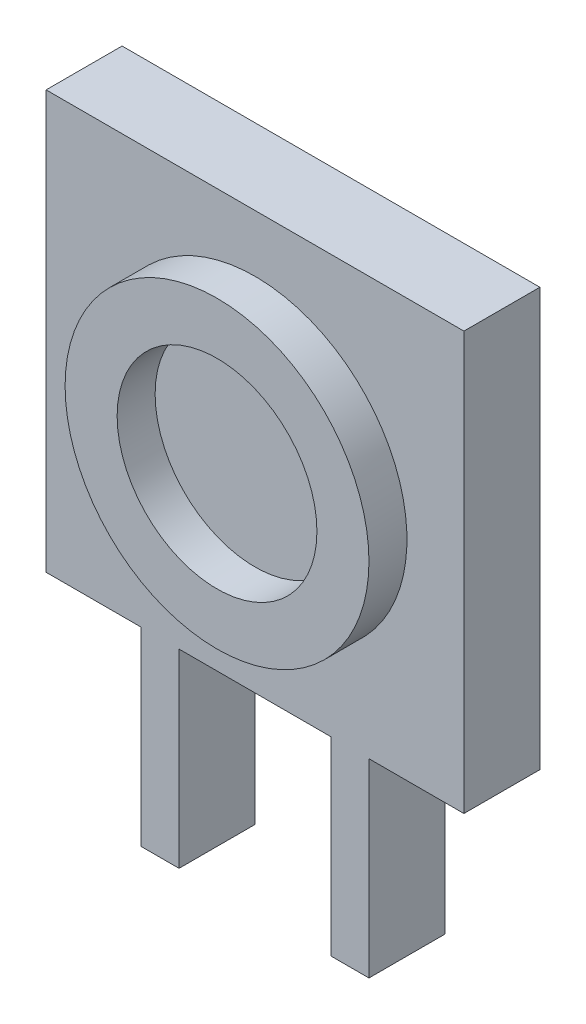
ISO-10303-21;
HEADER;
FILE_DESCRIPTION(('STEP AP214'),'2;1');
FILE_NAME('part.step','',(''),(''),'','','');
FILE_SCHEMA(('AUTOMOTIVE_DESIGN { 1 0 10303 214 1 1 1 1 }'));
ENDSEC;
DATA;
#1=APPLICATION_CONTEXT('core data for automotive mechanical design processes');
#2=APPLICATION_PROTOCOL_DEFINITION('international standard','automotive_design',2000,#1);
#3=PRODUCT_CONTEXT('',#1,'mechanical');
#4=PRODUCT('Part','Part','',(#3));
#5=PRODUCT_RELATED_PRODUCT_CATEGORY('part','',(#4));
#6=PRODUCT_DEFINITION_FORMATION('','',#4);
#7=PRODUCT_DEFINITION_CONTEXT('part definition',#1,'design');
#8=PRODUCT_DEFINITION('design','',#6,#7);
#9=PRODUCT_DEFINITION_SHAPE('','',#8);
#10=(LENGTH_UNIT() NAMED_UNIT(*) SI_UNIT(.MILLI.,.METRE.));
#11=(NAMED_UNIT(*) PLANE_ANGLE_UNIT() SI_UNIT($,.RADIAN.));
#12=(NAMED_UNIT(*) SI_UNIT($,.STERADIAN.) SOLID_ANGLE_UNIT());
#13=UNCERTAINTY_MEASURE_WITH_UNIT(LENGTH_MEASURE(1.E-05),#10,'distance_accuracy_value','');
#14=(GEOMETRIC_REPRESENTATION_CONTEXT(3) GLOBAL_UNCERTAINTY_ASSIGNED_CONTEXT((#13)) GLOBAL_UNIT_ASSIGNED_CONTEXT((#10,
#11,#12)) REPRESENTATION_CONTEXT('',''));
#15=CARTESIAN_POINT('',(0.,0.,0.));
#16=DIRECTION('',(0.,0.,1.));
#17=DIRECTION('',(1.,0.,0.));
#18=AXIS2_PLACEMENT_3D('',#15,#16,#17);
#19=CARTESIAN_POINT('',(-5.5,-10.5,2.));
#20=DIRECTION('',(0.,0.,-1.));
#21=DIRECTION('',(-1.,0.,0.));
#22=AXIS2_PLACEMENT_3D('',#19,#20,#21);
#23=PLANE('',#22);
#24=DIRECTION('',(0.,-1.,0.));
#25=VECTOR('',#24,1.);
#26=CARTESIAN_POINT('',(-5.5,-5.5,2.));
#27=LINE('',#26,#25);
#28=CARTESIAN_POINT('',(-5.5,5.5,2.));
#29=VERTEX_POINT('',#28);
#30=CARTESIAN_POINT('',(-5.5,-5.5,2.));
#31=VERTEX_POINT('',#30);
#32=EDGE_CURVE('E176',#29,#31,#27,.T.);
#33=ORIENTED_EDGE('',*,*,#32,.T.);
#34=DIRECTION('',(1.,0.,0.));
#35=VECTOR('',#34,1.);
#36=CARTESIAN_POINT('',(-5.5,-5.5,2.));
#37=LINE('',#36,#35);
#38=CARTESIAN_POINT('',(-3.,-5.5,2.));
#39=VERTEX_POINT('',#38);
#40=EDGE_CURVE('E104',#31,#39,#37,.T.);
#41=ORIENTED_EDGE('',*,*,#40,.T.);
#42=DIRECTION('',(0.,-1.,0.));
#43=VECTOR('',#42,1.);
#44=CARTESIAN_POINT('',(-3.,-5.5,2.));
#45=LINE('',#44,#43);
#46=CARTESIAN_POINT('',(-3.,-10.5,2.));
#47=VERTEX_POINT('',#46);
#48=EDGE_CURVE('E221',#39,#47,#45,.T.);
#49=ORIENTED_EDGE('',*,*,#48,.T.);
#50=DIRECTION('',(1.,0.,0.));
#51=VECTOR('',#50,1.);
#52=CARTESIAN_POINT('',(-3.,-10.5,2.));
#53=LINE('',#52,#51);
#54=CARTESIAN_POINT('',(-2.,-10.5,2.));
#55=VERTEX_POINT('',#54);
#56=EDGE_CURVE('E218',#47,#55,#53,.T.);
#57=ORIENTED_EDGE('',*,*,#56,.T.);
#58=DIRECTION('',(0.,1.,0.));
#59=VECTOR('',#58,1.);
#60=CARTESIAN_POINT('',(-2.,-5.5,2.));
#61=LINE('',#60,#59);
#62=CARTESIAN_POINT('',(-2.,-5.5,2.));
#63=VERTEX_POINT('',#62);
#64=EDGE_CURVE('E220',#55,#63,#61,.T.);
#65=ORIENTED_EDGE('',*,*,#64,.T.);
#66=DIRECTION('',(1.,0.,0.));
#67=VECTOR('',#66,1.);
#68=CARTESIAN_POINT('',(-2.,-5.5,2.));
#69=LINE('',#68,#67);
#70=CARTESIAN_POINT('',(2.,-5.5,2.));
#71=VERTEX_POINT('',#70);
#72=EDGE_CURVE('E223',#63,#71,#69,.T.);
#73=ORIENTED_EDGE('',*,*,#72,.T.);
#74=DIRECTION('',(0.,-1.,0.));
#75=VECTOR('',#74,1.);
#76=CARTESIAN_POINT('',(2.,-5.5,2.));
#77=LINE('',#76,#75);
#78=CARTESIAN_POINT('',(2.,-10.5,2.));
#79=VERTEX_POINT('',#78);
#80=EDGE_CURVE('E229',#71,#79,#77,.T.);
#81=ORIENTED_EDGE('',*,*,#80,.T.);
#82=DIRECTION('',(1.,0.,0.));
#83=VECTOR('',#82,1.);
#84=CARTESIAN_POINT('',(2.,-10.5,2.));
#85=LINE('',#84,#83);
#86=CARTESIAN_POINT('',(3.,-10.5,2.));
#87=VERTEX_POINT('',#86);
#88=EDGE_CURVE('E231',#79,#87,#85,.T.);
#89=ORIENTED_EDGE('',*,*,#88,.T.);
#90=DIRECTION('',(0.,1.,0.));
#91=VECTOR('',#90,1.);
#92=CARTESIAN_POINT('',(3.,-5.5,2.));
#93=LINE('',#92,#91);
#94=CARTESIAN_POINT('',(3.,-5.5,2.));
#95=VERTEX_POINT('',#94);
#96=EDGE_CURVE('E135',#87,#95,#93,.T.);
#97=ORIENTED_EDGE('',*,*,#96,.T.);
#98=DIRECTION('',(1.,0.,0.));
#99=VECTOR('',#98,1.);
#100=CARTESIAN_POINT('',(3.,-5.5,2.));
#101=LINE('',#100,#99);
#102=CARTESIAN_POINT('',(5.5,-5.5,2.));
#103=VERTEX_POINT('',#102);
#104=EDGE_CURVE('E129',#95,#103,#101,.T.);
#105=ORIENTED_EDGE('',*,*,#104,.T.);
#106=DIRECTION('',(0.,1.,0.));
#107=VECTOR('',#106,1.);
#108=CARTESIAN_POINT('',(5.5,-5.5,2.));
#109=LINE('',#108,#107);
#110=CARTESIAN_POINT('',(5.5,5.5,2.));
#111=VERTEX_POINT('',#110);
#112=EDGE_CURVE('E133',#103,#111,#109,.T.);
#113=ORIENTED_EDGE('',*,*,#112,.T.);
#114=DIRECTION('',(-1.,0.,0.));
#115=VECTOR('',#114,1.);
#116=CARTESIAN_POINT('',(-5.5,5.5,2.));
#117=LINE('',#116,#115);
#118=EDGE_CURVE('E48',#111,#29,#117,.T.);
#119=ORIENTED_EDGE('',*,*,#118,.T.);
#120=EDGE_LOOP('',(#33,#41,#49,#57,#65,#73,#81,#89,#97,#105,#113,#119));
#121=FACE_BOUND('',#120,.T.);
#122=CARTESIAN_POINT('',(0.,0.,2.));
#123=DIRECTION('',(0.,0.,-1.));
#124=DIRECTION('',(-1.,0.,0.));
#125=AXIS2_PLACEMENT_3D('',#122,#123,#124);
#126=CIRCLE('',#125,4.);
#127=CARTESIAN_POINT('',(-4.,0.,2.));
#128=VERTEX_POINT('',#127);
#129=EDGE_CURVE('E11',#128,#128,#126,.F.);
#130=ORIENTED_EDGE('',*,*,#129,.F.);
#131=EDGE_LOOP('',(#130));
#132=FACE_BOUND('',#131,.T.);
#133=ADVANCED_FACE('F31',(#121,#132),#23,.F.);
#134=CARTESIAN_POINT('',(-5.5,-5.5,2.));
#135=DIRECTION('',(1.,0.,0.));
#136=DIRECTION('',(0.,0.,-1.));
#137=AXIS2_PLACEMENT_3D('',#134,#135,#136);
#138=PLANE('',#137);
#139=DIRECTION('',(0.,-1.,0.));
#140=VECTOR('',#139,1.);
#141=CARTESIAN_POINT('',(-5.5,-5.5,0.));
#142=LINE('',#141,#140);
#143=CARTESIAN_POINT('',(-5.5,5.5,0.));
#144=VERTEX_POINT('',#143);
#145=CARTESIAN_POINT('',(-5.5,-5.5,0.));
#146=VERTEX_POINT('',#145);
#147=EDGE_CURVE('E153',#144,#146,#142,.T.);
#148=ORIENTED_EDGE('',*,*,#147,.T.);
#149=DIRECTION('',(0.,0.,-1.));
#150=VECTOR('',#149,1.);
#151=CARTESIAN_POINT('',(-5.5,-5.5,2.));
#152=LINE('',#151,#150);
#153=EDGE_CURVE('E40',#31,#146,#152,.T.);
#154=ORIENTED_EDGE('',*,*,#153,.F.);
#155=ORIENTED_EDGE('',*,*,#32,.F.);
#156=DIRECTION('',(0.,0.,-1.));
#157=VECTOR('',#156,1.);
#158=CARTESIAN_POINT('',(-5.5,5.5,2.));
#159=LINE('',#158,#157);
#160=EDGE_CURVE('E149',#29,#144,#159,.T.);
#161=ORIENTED_EDGE('',*,*,#160,.T.);
#162=EDGE_LOOP('',(#148,#154,#155,#161));
#163=FACE_BOUND('',#162,.T.);
#164=ADVANCED_FACE('F33',(#163),#138,.F.);
#165=CARTESIAN_POINT('',(-5.5,-5.5,2.));
#166=DIRECTION('',(0.,1.,0.));
#167=DIRECTION('',(0.,0.,1.));
#168=AXIS2_PLACEMENT_3D('',#165,#166,#167);
#169=PLANE('',#168);
#170=DIRECTION('',(1.,0.,0.));
#171=VECTOR('',#170,1.);
#172=CARTESIAN_POINT('',(-5.5,-5.5,0.));
#173=LINE('',#172,#171);
#174=CARTESIAN_POINT('',(-3.,-5.5,0.));
#175=VERTEX_POINT('',#174);
#176=EDGE_CURVE('E156',#146,#175,#173,.T.);
#177=ORIENTED_EDGE('',*,*,#176,.T.);
#178=DIRECTION('',(0.,0.,-1.));
#179=VECTOR('',#178,1.);
#180=CARTESIAN_POINT('',(-3.,-5.5,2.));
#181=LINE('',#180,#179);
#182=EDGE_CURVE('E198',#39,#175,#181,.T.);
#183=ORIENTED_EDGE('',*,*,#182,.F.);
#184=ORIENTED_EDGE('',*,*,#40,.F.);
#185=ORIENTED_EDGE('',*,*,#153,.T.);
#186=EDGE_LOOP('',(#177,#183,#184,#185));
#187=FACE_BOUND('',#186,.T.);
#188=ADVANCED_FACE('F201',(#187),#169,.F.);
#189=CARTESIAN_POINT('',(-3.,-5.5,2.));
#190=DIRECTION('',(1.,0.,0.));
#191=DIRECTION('',(0.,1.,0.));
#192=AXIS2_PLACEMENT_3D('',#189,#190,#191);
#193=PLANE('',#192);
#194=DIRECTION('',(0.,-1.,0.));
#195=VECTOR('',#194,1.);
#196=CARTESIAN_POINT('',(-3.,-5.5,0.));
#197=LINE('',#196,#195);
#198=CARTESIAN_POINT('',(-3.,-10.5,0.));
#199=VERTEX_POINT('',#198);
#200=EDGE_CURVE('E159',#175,#199,#197,.T.);
#201=ORIENTED_EDGE('',*,*,#200,.T.);
#202=DIRECTION('',(0.,0.,-1.));
#203=VECTOR('',#202,1.);
#204=CARTESIAN_POINT('',(-3.,-10.5,2.));
#205=LINE('',#204,#203);
#206=EDGE_CURVE('E195',#47,#199,#205,.T.);
#207=ORIENTED_EDGE('',*,*,#206,.F.);
#208=ORIENTED_EDGE('',*,*,#48,.F.);
#209=ORIENTED_EDGE('',*,*,#182,.T.);
#210=EDGE_LOOP('',(#201,#207,#208,#209));
#211=FACE_BOUND('',#210,.T.);
#212=ADVANCED_FACE('F212',(#211),#193,.F.);
#213=CARTESIAN_POINT('',(-3.,-10.5,2.));
#214=DIRECTION('',(0.,1.,0.));
#215=DIRECTION('',(0.,0.,1.));
#216=AXIS2_PLACEMENT_3D('',#213,#214,#215);
#217=PLANE('',#216);
#218=DIRECTION('',(1.,0.,0.));
#219=VECTOR('',#218,1.);
#220=CARTESIAN_POINT('',(-3.,-10.5,0.));
#221=LINE('',#220,#219);
#222=CARTESIAN_POINT('',(-2.,-10.5,0.));
#223=VERTEX_POINT('',#222);
#224=EDGE_CURVE('E161',#199,#223,#221,.T.);
#225=ORIENTED_EDGE('',*,*,#224,.T.);
#226=DIRECTION('',(0.,0.,-1.));
#227=VECTOR('',#226,1.);
#228=CARTESIAN_POINT('',(-2.,-10.5,2.));
#229=LINE('',#228,#227);
#230=EDGE_CURVE('E192',#55,#223,#229,.T.);
#231=ORIENTED_EDGE('',*,*,#230,.F.);
#232=ORIENTED_EDGE('',*,*,#56,.F.);
#233=ORIENTED_EDGE('',*,*,#206,.T.);
#234=EDGE_LOOP('',(#225,#231,#232,#233));
#235=FACE_BOUND('',#234,.T.);
#236=ADVANCED_FACE('F216',(#235),#217,.F.);
#237=CARTESIAN_POINT('',(-2.,-5.5,2.));
#238=DIRECTION('',(-1.,0.,0.));
#239=DIRECTION('',(0.,0.,1.));
#240=AXIS2_PLACEMENT_3D('',#237,#238,#239);
#241=PLANE('',#240);
#242=DIRECTION('',(0.,1.,0.));
#243=VECTOR('',#242,1.);
#244=CARTESIAN_POINT('',(-2.,-5.5,0.));
#245=LINE('',#244,#243);
#246=CARTESIAN_POINT('',(-2.,-5.5,0.));
#247=VERTEX_POINT('',#246);
#248=EDGE_CURVE('E163',#223,#247,#245,.T.);
#249=ORIENTED_EDGE('',*,*,#248,.T.);
#250=DIRECTION('',(0.,0.,-1.));
#251=VECTOR('',#250,1.);
#252=CARTESIAN_POINT('',(-2.,-5.5,2.));
#253=LINE('',#252,#251);
#254=EDGE_CURVE('E189',#63,#247,#253,.T.);
#255=ORIENTED_EDGE('',*,*,#254,.F.);
#256=ORIENTED_EDGE('',*,*,#64,.F.);
#257=ORIENTED_EDGE('',*,*,#230,.T.);
#258=EDGE_LOOP('',(#249,#255,#256,#257));
#259=FACE_BOUND('',#258,.T.);
#260=ADVANCED_FACE('F252',(#259),#241,.F.);
#261=CARTESIAN_POINT('',(-2.,-5.5,2.));
#262=DIRECTION('',(0.,1.,0.));
#263=DIRECTION('',(-1.,0.,0.));
#264=AXIS2_PLACEMENT_3D('',#261,#262,#263);
#265=PLANE('',#264);
#266=DIRECTION('',(1.,0.,0.));
#267=VECTOR('',#266,1.);
#268=CARTESIAN_POINT('',(-2.,-5.5,0.));
#269=LINE('',#268,#267);
#270=CARTESIAN_POINT('',(2.,-5.5,0.));
#271=VERTEX_POINT('',#270);
#272=EDGE_CURVE('E165',#247,#271,#269,.T.);
#273=ORIENTED_EDGE('',*,*,#272,.T.);
#274=DIRECTION('',(0.,0.,-1.));
#275=VECTOR('',#274,1.);
#276=CARTESIAN_POINT('',(2.,-5.5,2.));
#277=LINE('',#276,#275);
#278=EDGE_CURVE('E186',#71,#271,#277,.T.);
#279=ORIENTED_EDGE('',*,*,#278,.F.);
#280=ORIENTED_EDGE('',*,*,#72,.F.);
#281=ORIENTED_EDGE('',*,*,#254,.T.);
#282=EDGE_LOOP('',(#273,#279,#280,#281));
#283=FACE_BOUND('',#282,.T.);
#284=ADVANCED_FACE('F249',(#283),#265,.F.);
#285=CARTESIAN_POINT('',(2.,-5.5,2.));
#286=DIRECTION('',(1.,0.,0.));
#287=DIRECTION('',(0.,1.,0.));
#288=AXIS2_PLACEMENT_3D('',#285,#286,#287);
#289=PLANE('',#288);
#290=DIRECTION('',(0.,-1.,0.));
#291=VECTOR('',#290,1.);
#292=CARTESIAN_POINT('',(2.,-5.5,0.));
#293=LINE('',#292,#291);
#294=CARTESIAN_POINT('',(2.,-10.5,0.));
#295=VERTEX_POINT('',#294);
#296=EDGE_CURVE('E167',#271,#295,#293,.T.);
#297=ORIENTED_EDGE('',*,*,#296,.T.);
#298=DIRECTION('',(0.,0.,-1.));
#299=VECTOR('',#298,1.);
#300=CARTESIAN_POINT('',(2.,-10.5,2.));
#301=LINE('',#300,#299);
#302=EDGE_CURVE('E183',#79,#295,#301,.T.);
#303=ORIENTED_EDGE('',*,*,#302,.F.);
#304=ORIENTED_EDGE('',*,*,#80,.F.);
#305=ORIENTED_EDGE('',*,*,#278,.T.);
#306=EDGE_LOOP('',(#297,#303,#304,#305));
#307=FACE_BOUND('',#306,.T.);
#308=ADVANCED_FACE('F245',(#307),#289,.F.);
#309=CARTESIAN_POINT('',(2.,-10.5,2.));
#310=DIRECTION('',(0.,1.,0.));
#311=DIRECTION('',(0.,0.,1.));
#312=AXIS2_PLACEMENT_3D('',#309,#310,#311);
#313=PLANE('',#312);
#314=DIRECTION('',(1.,0.,0.));
#315=VECTOR('',#314,1.);
#316=CARTESIAN_POINT('',(2.,-10.5,0.));
#317=LINE('',#316,#315);
#318=CARTESIAN_POINT('',(3.,-10.5,0.));
#319=VERTEX_POINT('',#318);
#320=EDGE_CURVE('E169',#295,#319,#317,.T.);
#321=ORIENTED_EDGE('',*,*,#320,.T.);
#322=DIRECTION('',(0.,0.,-1.));
#323=VECTOR('',#322,1.);
#324=CARTESIAN_POINT('',(3.,-10.5,2.));
#325=LINE('',#324,#323);
#326=EDGE_CURVE('E180',#87,#319,#325,.T.);
#327=ORIENTED_EDGE('',*,*,#326,.F.);
#328=ORIENTED_EDGE('',*,*,#88,.F.);
#329=ORIENTED_EDGE('',*,*,#302,.T.);
#330=EDGE_LOOP('',(#321,#327,#328,#329));
#331=FACE_BOUND('',#330,.T.);
#332=ADVANCED_FACE('F237',(#331),#313,.F.);
#333=CARTESIAN_POINT('',(3.,-5.5,2.));
#334=DIRECTION('',(-1.,0.,0.));
#335=DIRECTION('',(0.,-1.,0.));
#336=AXIS2_PLACEMENT_3D('',#333,#334,#335);
#337=PLANE('',#336);
#338=DIRECTION('',(0.,1.,0.));
#339=VECTOR('',#338,1.);
#340=CARTESIAN_POINT('',(3.,-5.5,0.));
#341=LINE('',#340,#339);
#342=CARTESIAN_POINT('',(3.,-5.5,0.));
#343=VERTEX_POINT('',#342);
#344=EDGE_CURVE('E171',#319,#343,#341,.T.);
#345=ORIENTED_EDGE('',*,*,#344,.T.);
#346=DIRECTION('',(0.,0.,-1.));
#347=VECTOR('',#346,1.);
#348=CARTESIAN_POINT('',(3.,-5.5,2.));
#349=LINE('',#348,#347);
#350=EDGE_CURVE('E144',#95,#343,#349,.T.);
#351=ORIENTED_EDGE('',*,*,#350,.F.);
#352=ORIENTED_EDGE('',*,*,#96,.F.);
#353=ORIENTED_EDGE('',*,*,#326,.T.);
#354=EDGE_LOOP('',(#345,#351,#352,#353));
#355=FACE_BOUND('',#354,.T.);
#356=ADVANCED_FACE('F241',(#355),#337,.F.);
#357=CARTESIAN_POINT('',(3.,-5.5,2.));
#358=DIRECTION('',(0.,1.,0.));
#359=DIRECTION('',(-1.,0.,0.));
#360=AXIS2_PLACEMENT_3D('',#357,#358,#359);
#361=PLANE('',#360);
#362=DIRECTION('',(1.,0.,0.));
#363=VECTOR('',#362,1.);
#364=CARTESIAN_POINT('',(3.,-5.5,0.));
#365=LINE('',#364,#363);
#366=CARTESIAN_POINT('',(5.5,-5.5,0.));
#367=VERTEX_POINT('',#366);
#368=EDGE_CURVE('E143',#343,#367,#365,.T.);
#369=ORIENTED_EDGE('',*,*,#368,.T.);
#370=DIRECTION('',(0.,0.,-1.));
#371=VECTOR('',#370,1.);
#372=CARTESIAN_POINT('',(5.5,-5.5,2.));
#373=LINE('',#372,#371);
#374=EDGE_CURVE('E140',#103,#367,#373,.T.);
#375=ORIENTED_EDGE('',*,*,#374,.F.);
#376=ORIENTED_EDGE('',*,*,#104,.F.);
#377=ORIENTED_EDGE('',*,*,#350,.T.);
#378=EDGE_LOOP('',(#369,#375,#376,#377));
#379=FACE_BOUND('',#378,.T.);
#380=ADVANCED_FACE('F141',(#379),#361,.F.);
#381=CARTESIAN_POINT('',(5.5,-5.5,2.));
#382=DIRECTION('',(-1.,0.,0.));
#383=DIRECTION('',(0.,-1.,0.));
#384=AXIS2_PLACEMENT_3D('',#381,#382,#383);
#385=PLANE('',#384);
#386=DIRECTION('',(0.,1.,0.));
#387=VECTOR('',#386,1.);
#388=CARTESIAN_POINT('',(5.5,-5.5,0.));
#389=LINE('',#388,#387);
#390=CARTESIAN_POINT('',(5.5,5.5,0.));
#391=VERTEX_POINT('',#390);
#392=EDGE_CURVE('E89',#367,#391,#389,.T.);
#393=ORIENTED_EDGE('',*,*,#392,.T.);
#394=DIRECTION('',(0.,0.,-1.));
#395=VECTOR('',#394,1.);
#396=CARTESIAN_POINT('',(5.5,5.5,2.));
#397=LINE('',#396,#395);
#398=EDGE_CURVE('E145',#111,#391,#397,.T.);
#399=ORIENTED_EDGE('',*,*,#398,.F.);
#400=ORIENTED_EDGE('',*,*,#112,.F.);
#401=ORIENTED_EDGE('',*,*,#374,.T.);
#402=EDGE_LOOP('',(#393,#399,#400,#401));
#403=FACE_BOUND('',#402,.T.);
#404=ADVANCED_FACE('F147',(#403),#385,.F.);
#405=CARTESIAN_POINT('',(-5.5,5.5,2.));
#406=DIRECTION('',(0.,-1.,0.));
#407=DIRECTION('',(1.,0.,0.));
#408=AXIS2_PLACEMENT_3D('',#405,#406,#407);
#409=PLANE('',#408);
#410=DIRECTION('',(-1.,0.,0.));
#411=VECTOR('',#410,1.);
#412=CARTESIAN_POINT('',(-5.5,5.5,0.));
#413=LINE('',#412,#411);
#414=EDGE_CURVE('E95',#391,#144,#413,.T.);
#415=ORIENTED_EDGE('',*,*,#414,.T.);
#416=ORIENTED_EDGE('',*,*,#160,.F.);
#417=ORIENTED_EDGE('',*,*,#118,.F.);
#418=ORIENTED_EDGE('',*,*,#398,.T.);
#419=EDGE_LOOP('',(#415,#416,#417,#418));
#420=FACE_BOUND('',#419,.T.);
#421=ADVANCED_FACE('F304',(#420),#409,.F.);
#422=CARTESIAN_POINT('',(-5.5,-10.5,0.));
#423=DIRECTION('',(0.,0.,-1.));
#424=DIRECTION('',(-1.,0.,0.));
#425=AXIS2_PLACEMENT_3D('',#422,#423,#424);
#426=PLANE('',#425);
#427=ORIENTED_EDGE('',*,*,#147,.F.);
#428=ORIENTED_EDGE('',*,*,#414,.F.);
#429=ORIENTED_EDGE('',*,*,#392,.F.);
#430=ORIENTED_EDGE('',*,*,#368,.F.);
#431=ORIENTED_EDGE('',*,*,#344,.F.);
#432=ORIENTED_EDGE('',*,*,#320,.F.);
#433=ORIENTED_EDGE('',*,*,#296,.F.);
#434=ORIENTED_EDGE('',*,*,#272,.F.);
#435=ORIENTED_EDGE('',*,*,#248,.F.);
#436=ORIENTED_EDGE('',*,*,#224,.F.);
#437=ORIENTED_EDGE('',*,*,#200,.F.);
#438=ORIENTED_EDGE('',*,*,#176,.F.);
#439=EDGE_LOOP('',(#427,#428,#429,#430,#431,#432,#433,#434,#435,#436,#437,#438));
#440=FACE_BOUND('',#439,.T.);
#441=ADVANCED_FACE('F206',(#440),#426,.T.);
#442=CARTESIAN_POINT('',(0.,0.,3.));
#443=DIRECTION('',(0.,0.,1.));
#444=DIRECTION('',(1.,0.,0.));
#445=AXIS2_PLACEMENT_3D('',#442,#443,#444);
#446=PLANE('',#445);
#447=CARTESIAN_POINT('',(0.,0.,3.));
#448=DIRECTION('',(0.,0.,1.));
#449=DIRECTION('',(1.,0.,0.));
#450=AXIS2_PLACEMENT_3D('',#447,#448,#449);
#451=CIRCLE('',#450,4.);
#452=CARTESIAN_POINT('',(4.,0.,3.));
#453=VERTEX_POINT('',#452);
#454=EDGE_CURVE('E157',#453,#453,#451,.T.);
#455=ORIENTED_EDGE('',*,*,#454,.T.);
#456=EDGE_LOOP('',(#455));
#457=FACE_BOUND('',#456,.T.);
#458=CARTESIAN_POINT('',(0.,0.,3.));
#459=DIRECTION('',(0.,0.,1.));
#460=DIRECTION('',(1.,0.,0.));
#461=AXIS2_PLACEMENT_3D('',#458,#459,#460);
#462=CIRCLE('',#461,2.63);
#463=CARTESIAN_POINT('',(2.63,0.,3.));
#464=VERTEX_POINT('',#463);
#465=EDGE_CURVE('E282',#464,#464,#462,.T.);
#466=ORIENTED_EDGE('',*,*,#465,.F.);
#467=EDGE_LOOP('',(#466));
#468=FACE_BOUND('',#467,.T.);
#469=ADVANCED_FACE('F291',(#457,#468),#446,.T.);
#470=CARTESIAN_POINT('',(0.,0.,3.));
#471=DIRECTION('',(0.,0.,-1.));
#472=DIRECTION('',(-1.,0.,0.));
#473=AXIS2_PLACEMENT_3D('',#470,#471,#472);
#474=CYLINDRICAL_SURFACE('',#473,4.);
#475=ORIENTED_EDGE('',*,*,#454,.F.);
#476=EDGE_LOOP('',(#475));
#477=FACE_BOUND('',#476,.T.);
#478=ORIENTED_EDGE('',*,*,#129,.T.);
#479=EDGE_LOOP('',(#478));
#480=FACE_BOUND('',#479,.T.);
#481=ADVANCED_FACE('F275',(#477,#480),#474,.T.);
#482=CARTESIAN_POINT('',(0.,0.,3.));
#483=DIRECTION('',(0.,0.,-1.));
#484=DIRECTION('',(-1.,0.,0.));
#485=AXIS2_PLACEMENT_3D('',#482,#483,#484);
#486=CYLINDRICAL_SURFACE('',#485,2.63);
#487=ORIENTED_EDGE('',*,*,#465,.T.);
#488=EDGE_LOOP('',(#487));
#489=FACE_BOUND('',#488,.T.);
#490=CARTESIAN_POINT('',(0.,0.,2.));
#491=DIRECTION('',(0.,0.,1.));
#492=DIRECTION('',(1.,0.,0.));
#493=AXIS2_PLACEMENT_3D('',#490,#491,#492);
#494=CIRCLE('',#493,2.63);
#495=CARTESIAN_POINT('',(2.63,0.,2.));
#496=VERTEX_POINT('',#495);
#497=EDGE_CURVE('E280',#496,#496,#494,.T.);
#498=ORIENTED_EDGE('',*,*,#497,.F.);
#499=EDGE_LOOP('',(#498));
#500=FACE_BOUND('',#499,.T.);
#501=ADVANCED_FACE('F270',(#489,#500),#486,.F.);
#502=ORIENTED_EDGE('',*,*,#497,.T.);
#503=EDGE_LOOP('',(#502));
#504=FACE_BOUND('',#503,.T.);
#505=ADVANCED_FACE('F263',(#504),#23,.F.);
#506=CLOSED_SHELL('',(#133,#164,#188,#212,#236,#260,#284,#308,#332,#356,#380,#404,#421,#441,
#469,#481,#501,#505));
#507=MANIFOLD_SOLID_BREP('B2',#506);
#508=ADVANCED_BREP_SHAPE_REPRESENTATION('',(#18,#507),#14);
#509=SHAPE_DEFINITION_REPRESENTATION(#9,#508);
ENDSEC;
END-ISO-10303-21;
